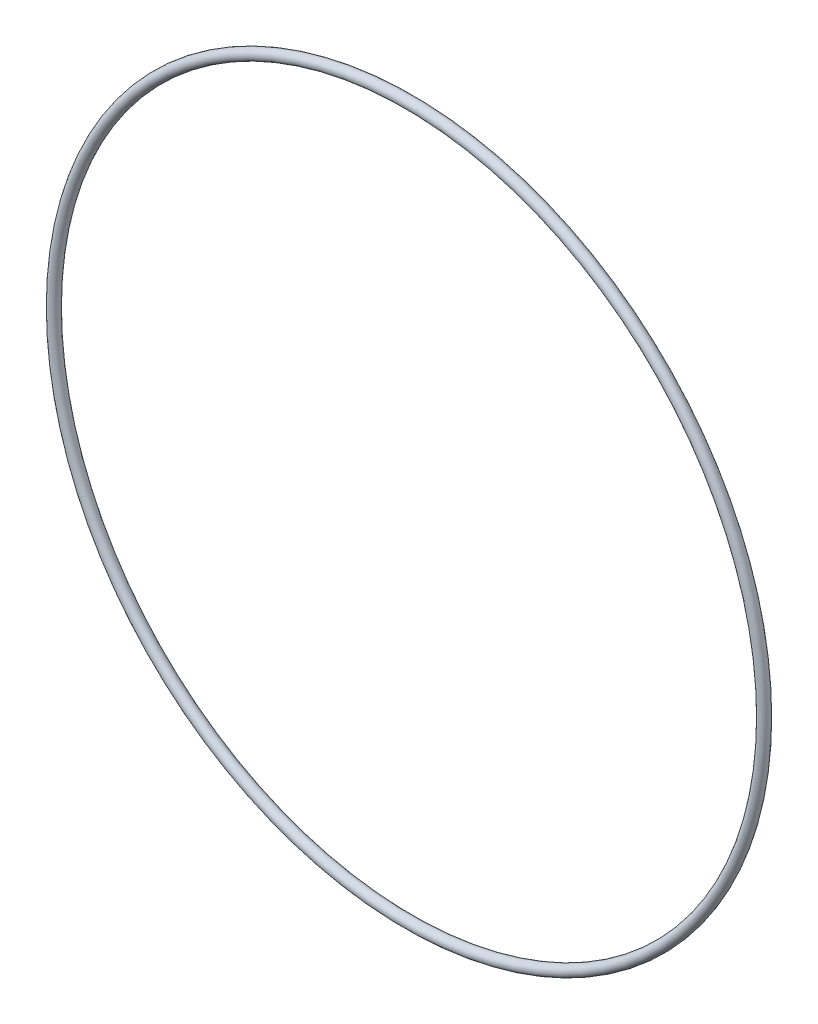
ISO-10303-21;
HEADER;
FILE_DESCRIPTION(('STEP AP214'),'2;1');
FILE_NAME('part.step','',(''),(''),'','','');
FILE_SCHEMA(('AUTOMOTIVE_DESIGN { 1 0 10303 214 1 1 1 1 }'));
ENDSEC;
DATA;
#1=APPLICATION_CONTEXT('core data for automotive mechanical design processes');
#2=APPLICATION_PROTOCOL_DEFINITION('international standard','automotive_design',2000,#1);
#3=PRODUCT_CONTEXT('',#1,'mechanical');
#4=PRODUCT('Part','Part','',(#3));
#5=PRODUCT_RELATED_PRODUCT_CATEGORY('part','',(#4));
#6=PRODUCT_DEFINITION_FORMATION('','',#4);
#7=PRODUCT_DEFINITION_CONTEXT('part definition',#1,'design');
#8=PRODUCT_DEFINITION('design','',#6,#7);
#9=PRODUCT_DEFINITION_SHAPE('','',#8);
#10=(LENGTH_UNIT() NAMED_UNIT(*) SI_UNIT(.MILLI.,.METRE.));
#11=(NAMED_UNIT(*) PLANE_ANGLE_UNIT() SI_UNIT($,.RADIAN.));
#12=(NAMED_UNIT(*) SI_UNIT($,.STERADIAN.) SOLID_ANGLE_UNIT());
#13=UNCERTAINTY_MEASURE_WITH_UNIT(LENGTH_MEASURE(1.E-05),#10,'distance_accuracy_value','');
#14=(GEOMETRIC_REPRESENTATION_CONTEXT(3) GLOBAL_UNCERTAINTY_ASSIGNED_CONTEXT((#13)) GLOBAL_UNIT_ASSIGNED_CONTEXT((#10,
#11,#12)) REPRESENTATION_CONTEXT('',''));
#15=CARTESIAN_POINT('',(0.,0.,0.));
#16=DIRECTION('',(0.,0.,1.));
#17=DIRECTION('',(1.,0.,0.));
#18=AXIS2_PLACEMENT_3D('',#15,#16,#17);
#19=CARTESIAN_POINT('',(0.,0.,0.));
#20=DIRECTION('',(0.,0.,1.));
#21=DIRECTION('',(1.,0.,0.));
#22=AXIS2_PLACEMENT_3D('',#19,#20,#21);
#23=TOROIDAL_SURFACE('',#22,86.868,1.30810000000001);
#24=CARTESIAN_POINT('',(88.1761,0.,0.));
#25=VERTEX_POINT('',#24);
#26=VERTEX_LOOP('',#25);
#27=FACE_BOUND('',#26,.T.);
#28=ADVANCED_FACE('F33',(#27),#23,.T.);
#29=CLOSED_SHELL('',(#28));
#30=MANIFOLD_SOLID_BREP('B2',#29);
#31=ADVANCED_BREP_SHAPE_REPRESENTATION('',(#18,#30),#14);
#32=SHAPE_DEFINITION_REPRESENTATION(#9,#31);
ENDSEC;
END-ISO-10303-21;
